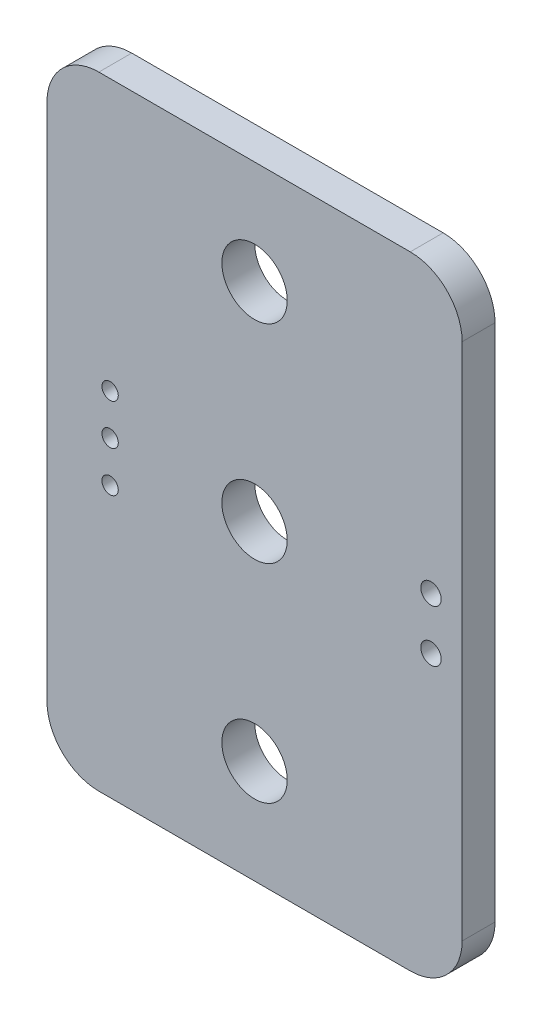
ISO-10303-21;
HEADER;
FILE_DESCRIPTION(('STEP AP214'),'2;1');
FILE_NAME('part.step','',(''),(''),'','','');
FILE_SCHEMA(('AUTOMOTIVE_DESIGN { 1 0 10303 214 1 1 1 1 }'));
ENDSEC;
DATA;
#1=APPLICATION_CONTEXT('core data for automotive mechanical design processes');
#2=APPLICATION_PROTOCOL_DEFINITION('international standard','automotive_design',2000,#1);
#3=PRODUCT_CONTEXT('',#1,'mechanical');
#4=PRODUCT('Part','Part','',(#3));
#5=PRODUCT_RELATED_PRODUCT_CATEGORY('part','',(#4));
#6=PRODUCT_DEFINITION_FORMATION('','',#4);
#7=PRODUCT_DEFINITION_CONTEXT('part definition',#1,'design');
#8=PRODUCT_DEFINITION('design','',#6,#7);
#9=PRODUCT_DEFINITION_SHAPE('','',#8);
#10=(LENGTH_UNIT() NAMED_UNIT(*) SI_UNIT(.MILLI.,.METRE.));
#11=(NAMED_UNIT(*) PLANE_ANGLE_UNIT() SI_UNIT($,.RADIAN.));
#12=(NAMED_UNIT(*) SI_UNIT($,.STERADIAN.) SOLID_ANGLE_UNIT());
#13=UNCERTAINTY_MEASURE_WITH_UNIT(LENGTH_MEASURE(1.E-05),#10,'distance_accuracy_value','');
#14=(GEOMETRIC_REPRESENTATION_CONTEXT(3) GLOBAL_UNCERTAINTY_ASSIGNED_CONTEXT((#13)) GLOBAL_UNIT_ASSIGNED_CONTEXT((#10,
#11,#12)) REPRESENTATION_CONTEXT('',''));
#15=CARTESIAN_POINT('',(0.,0.,0.));
#16=DIRECTION('',(0.,0.,1.));
#17=DIRECTION('',(1.,0.,0.));
#18=AXIS2_PLACEMENT_3D('',#15,#16,#17);
#19=CARTESIAN_POINT('',(25.4,27.94,1.61064));
#20=DIRECTION('',(0.,0.,-1.));
#21=DIRECTION('',(-1.,0.,0.));
#22=AXIS2_PLACEMENT_3D('',#19,#20,#21);
#23=CYLINDRICAL_SURFACE('',#22,2.54);
#24=CARTESIAN_POINT('',(25.4,27.94,0.));
#25=DIRECTION('',(0.,0.,1.));
#26=DIRECTION('',(-1.,0.,0.));
#27=AXIS2_PLACEMENT_3D('',#24,#25,#26);
#28=CIRCLE('',#27,2.54);
#29=CARTESIAN_POINT('',(22.86,27.94,0.));
#30=VERTEX_POINT('',#29);
#31=CARTESIAN_POINT('',(25.4,25.4,0.));
#32=VERTEX_POINT('',#31);
#33=EDGE_CURVE('E137',#30,#32,#28,.T.);
#34=ORIENTED_EDGE('',*,*,#33,.T.);
#35=DIRECTION('',(0.,0.,-1.));
#36=VECTOR('',#35,1.);
#37=CARTESIAN_POINT('',(25.4,25.4,1.61064));
#38=LINE('',#37,#36);
#39=CARTESIAN_POINT('',(25.4,25.4,1.61064));
#40=VERTEX_POINT('',#39);
#41=EDGE_CURVE('E11',#40,#32,#38,.T.);
#42=ORIENTED_EDGE('',*,*,#41,.F.);
#43=CARTESIAN_POINT('',(25.4,27.94,1.61064));
#44=DIRECTION('',(0.,0.,1.));
#45=DIRECTION('',(-1.,0.,0.));
#46=AXIS2_PLACEMENT_3D('',#43,#44,#45);
#47=CIRCLE('',#46,2.54);
#48=CARTESIAN_POINT('',(22.86,27.94,1.61064));
#49=VERTEX_POINT('',#48);
#50=EDGE_CURVE('E152',#49,#40,#47,.T.);
#51=ORIENTED_EDGE('',*,*,#50,.F.);
#52=DIRECTION('',(0.,0.,-1.));
#53=VECTOR('',#52,1.);
#54=CARTESIAN_POINT('',(22.86,27.94,1.61064));
#55=LINE('',#54,#53);
#56=EDGE_CURVE('E133',#49,#30,#55,.T.);
#57=ORIENTED_EDGE('',*,*,#56,.T.);
#58=EDGE_LOOP('',(#34,#42,#51,#57));
#59=FACE_BOUND('',#58,.T.);
#60=ADVANCED_FACE('F41',(#59),#23,.T.);
#61=CARTESIAN_POINT('',(40.64,25.4,1.61064));
#62=DIRECTION('',(0.,1.,0.));
#63=DIRECTION('',(0.,0.,1.));
#64=AXIS2_PLACEMENT_3D('',#61,#62,#63);
#65=PLANE('',#64);
#66=DIRECTION('',(1.,0.,0.));
#67=VECTOR('',#66,1.);
#68=CARTESIAN_POINT('',(40.64,25.4,0.));
#69=LINE('',#68,#67);
#70=CARTESIAN_POINT('',(40.64,25.4,0.));
#71=VERTEX_POINT('',#70);
#72=EDGE_CURVE('E140',#32,#71,#69,.T.);
#73=ORIENTED_EDGE('',*,*,#72,.T.);
#74=DIRECTION('',(0.,0.,-1.));
#75=VECTOR('',#74,1.);
#76=CARTESIAN_POINT('',(40.64,25.4,1.61064));
#77=LINE('',#76,#75);
#78=CARTESIAN_POINT('',(40.64,25.4,1.61064));
#79=VERTEX_POINT('',#78);
#80=EDGE_CURVE('E49',#79,#71,#77,.T.);
#81=ORIENTED_EDGE('',*,*,#80,.F.);
#82=DIRECTION('',(1.,0.,0.));
#83=VECTOR('',#82,1.);
#84=CARTESIAN_POINT('',(40.64,25.4,1.61064));
#85=LINE('',#84,#83);
#86=EDGE_CURVE('E100',#40,#79,#85,.T.);
#87=ORIENTED_EDGE('',*,*,#86,.F.);
#88=ORIENTED_EDGE('',*,*,#41,.T.);
#89=EDGE_LOOP('',(#73,#81,#87,#88));
#90=FACE_BOUND('',#89,.T.);
#91=ADVANCED_FACE('F266',(#90),#65,.F.);
#92=CARTESIAN_POINT('',(40.64,27.94,1.61064));
#93=DIRECTION('',(0.,0.,-1.));
#94=DIRECTION('',(-1.,0.,0.));
#95=AXIS2_PLACEMENT_3D('',#92,#93,#94);
#96=CYLINDRICAL_SURFACE('',#95,2.54);
#97=CARTESIAN_POINT('',(40.64,27.94,0.));
#98=DIRECTION('',(0.,0.,1.));
#99=DIRECTION('',(-1.,0.,0.));
#100=AXIS2_PLACEMENT_3D('',#97,#98,#99);
#101=CIRCLE('',#100,2.54);
#102=CARTESIAN_POINT('',(43.18,27.94,0.));
#103=VERTEX_POINT('',#102);
#104=EDGE_CURVE('E143',#71,#103,#101,.T.);
#105=ORIENTED_EDGE('',*,*,#104,.T.);
#106=DIRECTION('',(0.,0.,-1.));
#107=VECTOR('',#106,1.);
#108=CARTESIAN_POINT('',(43.18,27.94,1.61064));
#109=LINE('',#108,#107);
#110=CARTESIAN_POINT('',(43.18,27.94,1.61064));
#111=VERTEX_POINT('',#110);
#112=EDGE_CURVE('E159',#111,#103,#109,.T.);
#113=ORIENTED_EDGE('',*,*,#112,.F.);
#114=CARTESIAN_POINT('',(40.64,27.94,1.61064));
#115=DIRECTION('',(0.,0.,1.));
#116=DIRECTION('',(-1.,0.,0.));
#117=AXIS2_PLACEMENT_3D('',#114,#115,#116);
#118=CIRCLE('',#117,2.54);
#119=EDGE_CURVE('E167',#79,#111,#118,.T.);
#120=ORIENTED_EDGE('',*,*,#119,.F.);
#121=ORIENTED_EDGE('',*,*,#80,.T.);
#122=EDGE_LOOP('',(#105,#113,#120,#121));
#123=FACE_BOUND('',#122,.T.);
#124=ADVANCED_FACE('F165',(#123),#96,.T.);
#125=CARTESIAN_POINT('',(43.18,53.34,1.61064));
#126=DIRECTION('',(-1.,0.,0.));
#127=DIRECTION('',(0.,0.,1.));
#128=AXIS2_PLACEMENT_3D('',#125,#126,#127);
#129=PLANE('',#128);
#130=DIRECTION('',(0.,1.,0.));
#131=VECTOR('',#130,1.);
#132=CARTESIAN_POINT('',(43.18,53.34,0.));
#133=LINE('',#132,#131);
#134=CARTESIAN_POINT('',(43.18,53.34,0.));
#135=VERTEX_POINT('',#134);
#136=EDGE_CURVE('E145',#103,#135,#133,.T.);
#137=ORIENTED_EDGE('',*,*,#136,.T.);
#138=DIRECTION('',(0.,0.,-1.));
#139=VECTOR('',#138,1.);
#140=CARTESIAN_POINT('',(43.18,53.34,1.61064));
#141=LINE('',#140,#139);
#142=CARTESIAN_POINT('',(43.18,53.34,1.61064));
#143=VERTEX_POINT('',#142);
#144=EDGE_CURVE('E156',#143,#135,#141,.T.);
#145=ORIENTED_EDGE('',*,*,#144,.F.);
#146=DIRECTION('',(0.,1.,0.));
#147=VECTOR('',#146,1.);
#148=CARTESIAN_POINT('',(43.18,53.34,1.61064));
#149=LINE('',#148,#147);
#150=EDGE_CURVE('E179',#111,#143,#149,.T.);
#151=ORIENTED_EDGE('',*,*,#150,.F.);
#152=ORIENTED_EDGE('',*,*,#112,.T.);
#153=EDGE_LOOP('',(#137,#145,#151,#152));
#154=FACE_BOUND('',#153,.T.);
#155=ADVANCED_FACE('F175',(#154),#129,.F.);
#156=CARTESIAN_POINT('',(40.64,53.34,1.61064));
#157=DIRECTION('',(0.,0.,-1.));
#158=DIRECTION('',(-1.,0.,0.));
#159=AXIS2_PLACEMENT_3D('',#156,#157,#158);
#160=CYLINDRICAL_SURFACE('',#159,2.54);
#161=CARTESIAN_POINT('',(40.64,53.34,0.));
#162=DIRECTION('',(0.,0.,1.));
#163=DIRECTION('',(-1.,0.,0.));
#164=AXIS2_PLACEMENT_3D('',#161,#162,#163);
#165=CIRCLE('',#164,2.54);
#166=CARTESIAN_POINT('',(40.64,55.88,0.));
#167=VERTEX_POINT('',#166);
#168=EDGE_CURVE('E147',#135,#167,#165,.T.);
#169=ORIENTED_EDGE('',*,*,#168,.T.);
#170=DIRECTION('',(0.,0.,-1.));
#171=VECTOR('',#170,1.);
#172=CARTESIAN_POINT('',(40.64,55.88,1.61064));
#173=LINE('',#172,#171);
#174=CARTESIAN_POINT('',(40.64,55.88,1.61064));
#175=VERTEX_POINT('',#174);
#176=EDGE_CURVE('E128',#175,#167,#173,.T.);
#177=ORIENTED_EDGE('',*,*,#176,.F.);
#178=CARTESIAN_POINT('',(40.64,53.34,1.61064));
#179=DIRECTION('',(0.,0.,1.));
#180=DIRECTION('',(-1.,0.,0.));
#181=AXIS2_PLACEMENT_3D('',#178,#179,#180);
#182=CIRCLE('',#181,2.54);
#183=EDGE_CURVE('E119',#143,#175,#182,.T.);
#184=ORIENTED_EDGE('',*,*,#183,.F.);
#185=ORIENTED_EDGE('',*,*,#144,.T.);
#186=EDGE_LOOP('',(#169,#177,#184,#185));
#187=FACE_BOUND('',#186,.T.);
#188=ADVANCED_FACE('F178',(#187),#160,.T.);
#189=CARTESIAN_POINT('',(25.4,55.88,1.61064));
#190=DIRECTION('',(0.,-1.,0.));
#191=DIRECTION('',(0.,0.,-1.));
#192=AXIS2_PLACEMENT_3D('',#189,#190,#191);
#193=PLANE('',#192);
#194=DIRECTION('',(-1.,0.,0.));
#195=VECTOR('',#194,1.);
#196=CARTESIAN_POINT('',(25.4,55.88,0.));
#197=LINE('',#196,#195);
#198=CARTESIAN_POINT('',(25.4,55.88,0.));
#199=VERTEX_POINT('',#198);
#200=EDGE_CURVE('E127',#167,#199,#197,.T.);
#201=ORIENTED_EDGE('',*,*,#200,.T.);
#202=DIRECTION('',(0.,0.,-1.));
#203=VECTOR('',#202,1.);
#204=CARTESIAN_POINT('',(25.4,55.88,1.61064));
#205=LINE('',#204,#203);
#206=CARTESIAN_POINT('',(25.4,55.88,1.61064));
#207=VERTEX_POINT('',#206);
#208=EDGE_CURVE('E124',#207,#199,#205,.T.);
#209=ORIENTED_EDGE('',*,*,#208,.F.);
#210=DIRECTION('',(-1.,0.,0.));
#211=VECTOR('',#210,1.);
#212=CARTESIAN_POINT('',(25.4,55.88,1.61064));
#213=LINE('',#212,#211);
#214=EDGE_CURVE('E113',#175,#207,#213,.T.);
#215=ORIENTED_EDGE('',*,*,#214,.F.);
#216=ORIENTED_EDGE('',*,*,#176,.T.);
#217=EDGE_LOOP('',(#201,#209,#215,#216));
#218=FACE_BOUND('',#217,.T.);
#219=ADVANCED_FACE('F125',(#218),#193,.F.);
#220=CARTESIAN_POINT('',(25.4,53.34,1.61064));
#221=DIRECTION('',(0.,0.,-1.));
#222=DIRECTION('',(-1.,0.,0.));
#223=AXIS2_PLACEMENT_3D('',#220,#221,#222);
#224=CYLINDRICAL_SURFACE('',#223,2.54);
#225=CARTESIAN_POINT('',(25.4,53.34,0.));
#226=DIRECTION('',(0.,0.,1.));
#227=DIRECTION('',(-1.,0.,0.));
#228=AXIS2_PLACEMENT_3D('',#225,#226,#227);
#229=CIRCLE('',#228,2.54);
#230=CARTESIAN_POINT('',(22.86,53.34,0.));
#231=VERTEX_POINT('',#230);
#232=EDGE_CURVE('E86',#199,#231,#229,.T.);
#233=ORIENTED_EDGE('',*,*,#232,.T.);
#234=DIRECTION('',(0.,0.,-1.));
#235=VECTOR('',#234,1.);
#236=CARTESIAN_POINT('',(22.86,53.34,1.61064));
#237=LINE('',#236,#235);
#238=CARTESIAN_POINT('',(22.86,53.34,1.61064));
#239=VERTEX_POINT('',#238);
#240=EDGE_CURVE('E129',#239,#231,#237,.T.);
#241=ORIENTED_EDGE('',*,*,#240,.F.);
#242=CARTESIAN_POINT('',(25.4,53.34,1.61064));
#243=DIRECTION('',(0.,0.,1.));
#244=DIRECTION('',(-1.,0.,0.));
#245=AXIS2_PLACEMENT_3D('',#242,#243,#244);
#246=CIRCLE('',#245,2.54);
#247=EDGE_CURVE('E117',#207,#239,#246,.T.);
#248=ORIENTED_EDGE('',*,*,#247,.F.);
#249=ORIENTED_EDGE('',*,*,#208,.T.);
#250=EDGE_LOOP('',(#233,#241,#248,#249));
#251=FACE_BOUND('',#250,.T.);
#252=ADVANCED_FACE('F131',(#251),#224,.T.);
#253=CARTESIAN_POINT('',(22.86,27.94,1.61064));
#254=DIRECTION('',(1.,0.,0.));
#255=DIRECTION('',(0.,0.,-1.));
#256=AXIS2_PLACEMENT_3D('',#253,#254,#255);
#257=PLANE('',#256);
#258=DIRECTION('',(0.,-1.,0.));
#259=VECTOR('',#258,1.);
#260=CARTESIAN_POINT('',(22.86,27.94,0.));
#261=LINE('',#260,#259);
#262=EDGE_CURVE('E92',#231,#30,#261,.T.);
#263=ORIENTED_EDGE('',*,*,#262,.T.);
#264=ORIENTED_EDGE('',*,*,#56,.F.);
#265=DIRECTION('',(0.,-1.,0.));
#266=VECTOR('',#265,1.);
#267=CARTESIAN_POINT('',(22.86,27.94,1.61064));
#268=LINE('',#267,#266);
#269=EDGE_CURVE('E57',#239,#49,#268,.T.);
#270=ORIENTED_EDGE('',*,*,#269,.F.);
#271=ORIENTED_EDGE('',*,*,#240,.T.);
#272=EDGE_LOOP('',(#263,#264,#270,#271));
#273=FACE_BOUND('',#272,.T.);
#274=ADVANCED_FACE('F273',(#273),#257,.F.);
#275=CARTESIAN_POINT('',(25.4,27.94,1.61064));
#276=DIRECTION('',(0.,0.,-1.));
#277=DIRECTION('',(-1.,0.,0.));
#278=AXIS2_PLACEMENT_3D('',#275,#276,#277);
#279=PLANE('',#278);
#280=CARTESIAN_POINT('',(33.02,30.48,1.61064));
#281=DIRECTION('',(0.,0.,-1.));
#282=DIRECTION('',(-1.,0.,0.));
#283=AXIS2_PLACEMENT_3D('',#280,#281,#282);
#284=CIRCLE('',#283,1.59999999999999);
#285=CARTESIAN_POINT('',(31.42,30.48,1.61064));
#286=VERTEX_POINT('',#285);
#287=EDGE_CURVE('E226',#286,#286,#284,.T.);
#288=ORIENTED_EDGE('',*,*,#287,.T.);
#289=EDGE_LOOP('',(#288));
#290=FACE_BOUND('',#289,.T.);
#291=CARTESIAN_POINT('',(33.02,50.8,1.61064));
#292=DIRECTION('',(0.,0.,-1.));
#293=DIRECTION('',(-1.,0.,0.));
#294=AXIS2_PLACEMENT_3D('',#291,#292,#293);
#295=CIRCLE('',#294,1.59999999999999);
#296=CARTESIAN_POINT('',(31.42,50.8,1.61064));
#297=VERTEX_POINT('',#296);
#298=EDGE_CURVE('E220',#297,#297,#295,.T.);
#299=ORIENTED_EDGE('',*,*,#298,.T.);
#300=EDGE_LOOP('',(#299));
#301=FACE_BOUND('',#300,.T.);
#302=CARTESIAN_POINT('',(25.95,42.64,1.61064));
#303=DIRECTION('',(0.,0.,-1.));
#304=DIRECTION('',(-1.,0.,0.));
#305=AXIS2_PLACEMENT_3D('',#302,#303,#304);
#306=CIRCLE('',#305,0.399999999999987);
#307=CARTESIAN_POINT('',(25.55,42.64,1.61064));
#308=VERTEX_POINT('',#307);
#309=EDGE_CURVE('E214',#308,#308,#306,.T.);
#310=ORIENTED_EDGE('',*,*,#309,.T.);
#311=EDGE_LOOP('',(#310));
#312=FACE_BOUND('',#311,.T.);
#313=CARTESIAN_POINT('',(25.95,40.64,1.61064));
#314=DIRECTION('',(0.,0.,-1.));
#315=DIRECTION('',(-1.,0.,0.));
#316=AXIS2_PLACEMENT_3D('',#313,#314,#315);
#317=CIRCLE('',#316,0.399999999999987);
#318=CARTESIAN_POINT('',(25.55,40.64,1.61064));
#319=VERTEX_POINT('',#318);
#320=EDGE_CURVE('E208',#319,#319,#317,.T.);
#321=ORIENTED_EDGE('',*,*,#320,.T.);
#322=EDGE_LOOP('',(#321));
#323=FACE_BOUND('',#322,.T.);
#324=CARTESIAN_POINT('',(25.95,38.64,1.61064));
#325=DIRECTION('',(0.,0.,-1.));
#326=DIRECTION('',(-1.,0.,0.));
#327=AXIS2_PLACEMENT_3D('',#324,#325,#326);
#328=CIRCLE('',#327,0.399999999999987);
#329=CARTESIAN_POINT('',(25.55,38.64,1.61064));
#330=VERTEX_POINT('',#329);
#331=EDGE_CURVE('E202',#330,#330,#328,.T.);
#332=ORIENTED_EDGE('',*,*,#331,.T.);
#333=EDGE_LOOP('',(#332));
#334=FACE_BOUND('',#333,.T.);
#335=CARTESIAN_POINT('',(41.656,41.91,1.61064));
#336=DIRECTION('',(0.,0.,-1.));
#337=DIRECTION('',(-1.,0.,0.));
#338=AXIS2_PLACEMENT_3D('',#335,#336,#337);
#339=CIRCLE('',#338,0.499999999999987);
#340=CARTESIAN_POINT('',(41.156,41.91,1.61064));
#341=VERTEX_POINT('',#340);
#342=EDGE_CURVE('E196',#341,#341,#339,.T.);
#343=ORIENTED_EDGE('',*,*,#342,.T.);
#344=EDGE_LOOP('',(#343));
#345=FACE_BOUND('',#344,.T.);
#346=CARTESIAN_POINT('',(41.656,39.37,1.61064));
#347=DIRECTION('',(0.,0.,-1.));
#348=DIRECTION('',(-1.,0.,0.));
#349=AXIS2_PLACEMENT_3D('',#346,#347,#348);
#350=CIRCLE('',#349,0.499999999999987);
#351=CARTESIAN_POINT('',(41.156,39.37,1.61064));
#352=VERTEX_POINT('',#351);
#353=EDGE_CURVE('E190',#352,#352,#350,.T.);
#354=ORIENTED_EDGE('',*,*,#353,.T.);
#355=EDGE_LOOP('',(#354));
#356=FACE_BOUND('',#355,.T.);
#357=CARTESIAN_POINT('',(33.02,40.64,1.61064));
#358=DIRECTION('',(0.,0.,-1.));
#359=DIRECTION('',(-1.,0.,0.));
#360=AXIS2_PLACEMENT_3D('',#357,#358,#359);
#361=CIRCLE('',#360,1.59999999999999);
#362=CARTESIAN_POINT('',(31.42,40.64,1.61064));
#363=VERTEX_POINT('',#362);
#364=EDGE_CURVE('E141',#363,#363,#361,.T.);
#365=ORIENTED_EDGE('',*,*,#364,.T.);
#366=EDGE_LOOP('',(#365));
#367=FACE_BOUND('',#366,.T.);
#368=ORIENTED_EDGE('',*,*,#50,.T.);
#369=ORIENTED_EDGE('',*,*,#86,.T.);
#370=ORIENTED_EDGE('',*,*,#119,.T.);
#371=ORIENTED_EDGE('',*,*,#150,.T.);
#372=ORIENTED_EDGE('',*,*,#183,.T.);
#373=ORIENTED_EDGE('',*,*,#214,.T.);
#374=ORIENTED_EDGE('',*,*,#247,.T.);
#375=ORIENTED_EDGE('',*,*,#269,.T.);
#376=EDGE_LOOP('',(#368,#369,#370,#371,#372,#373,#374,#375));
#377=FACE_BOUND('',#376,.T.);
#378=ADVANCED_FACE('F115',(#290,#301,#312,#323,#334,#345,#356,#367,#377),#279,.F.);
#379=CARTESIAN_POINT('',(25.4,27.94,0.));
#380=DIRECTION('',(0.,0.,-1.));
#381=DIRECTION('',(-1.,0.,0.));
#382=AXIS2_PLACEMENT_3D('',#379,#380,#381);
#383=PLANE('',#382);
#384=CARTESIAN_POINT('',(33.02,30.48,0.));
#385=DIRECTION('',(0.,0.,-1.));
#386=DIRECTION('',(-1.,0.,0.));
#387=AXIS2_PLACEMENT_3D('',#384,#385,#386);
#388=CIRCLE('',#387,1.59999999999998);
#389=CARTESIAN_POINT('',(31.42,30.48,0.));
#390=VERTEX_POINT('',#389);
#391=EDGE_CURVE('E229',#390,#390,#388,.T.);
#392=ORIENTED_EDGE('',*,*,#391,.F.);
#393=EDGE_LOOP('',(#392));
#394=FACE_BOUND('',#393,.T.);
#395=CARTESIAN_POINT('',(33.02,50.8,0.));
#396=DIRECTION('',(0.,0.,-1.));
#397=DIRECTION('',(-1.,0.,0.));
#398=AXIS2_PLACEMENT_3D('',#395,#396,#397);
#399=CIRCLE('',#398,1.59999999999998);
#400=CARTESIAN_POINT('',(31.42,50.8,0.));
#401=VERTEX_POINT('',#400);
#402=EDGE_CURVE('E223',#401,#401,#399,.T.);
#403=ORIENTED_EDGE('',*,*,#402,.F.);
#404=EDGE_LOOP('',(#403));
#405=FACE_BOUND('',#404,.T.);
#406=CARTESIAN_POINT('',(25.95,42.64,0.));
#407=DIRECTION('',(0.,0.,-1.));
#408=DIRECTION('',(-1.,0.,0.));
#409=AXIS2_PLACEMENT_3D('',#406,#407,#408);
#410=CIRCLE('',#409,0.399999999999987);
#411=CARTESIAN_POINT('',(25.55,42.64,0.));
#412=VERTEX_POINT('',#411);
#413=EDGE_CURVE('E217',#412,#412,#410,.T.);
#414=ORIENTED_EDGE('',*,*,#413,.F.);
#415=EDGE_LOOP('',(#414));
#416=FACE_BOUND('',#415,.T.);
#417=CARTESIAN_POINT('',(25.95,40.64,0.));
#418=DIRECTION('',(0.,0.,-1.));
#419=DIRECTION('',(-1.,0.,0.));
#420=AXIS2_PLACEMENT_3D('',#417,#418,#419);
#421=CIRCLE('',#420,0.399999999999987);
#422=CARTESIAN_POINT('',(25.55,40.64,0.));
#423=VERTEX_POINT('',#422);
#424=EDGE_CURVE('E211',#423,#423,#421,.T.);
#425=ORIENTED_EDGE('',*,*,#424,.F.);
#426=EDGE_LOOP('',(#425));
#427=FACE_BOUND('',#426,.T.);
#428=CARTESIAN_POINT('',(25.95,38.64,0.));
#429=DIRECTION('',(0.,0.,-1.));
#430=DIRECTION('',(-1.,0.,0.));
#431=AXIS2_PLACEMENT_3D('',#428,#429,#430);
#432=CIRCLE('',#431,0.399999999999987);
#433=CARTESIAN_POINT('',(25.55,38.64,0.));
#434=VERTEX_POINT('',#433);
#435=EDGE_CURVE('E205',#434,#434,#432,.T.);
#436=ORIENTED_EDGE('',*,*,#435,.F.);
#437=EDGE_LOOP('',(#436));
#438=FACE_BOUND('',#437,.T.);
#439=CARTESIAN_POINT('',(41.656,41.91,0.));
#440=DIRECTION('',(0.,0.,-1.));
#441=DIRECTION('',(-1.,0.,0.));
#442=AXIS2_PLACEMENT_3D('',#439,#440,#441);
#443=CIRCLE('',#442,0.499999999999987);
#444=CARTESIAN_POINT('',(41.156,41.91,0.));
#445=VERTEX_POINT('',#444);
#446=EDGE_CURVE('E199',#445,#445,#443,.T.);
#447=ORIENTED_EDGE('',*,*,#446,.F.);
#448=EDGE_LOOP('',(#447));
#449=FACE_BOUND('',#448,.T.);
#450=CARTESIAN_POINT('',(41.656,39.37,0.));
#451=DIRECTION('',(0.,0.,-1.));
#452=DIRECTION('',(-1.,0.,0.));
#453=AXIS2_PLACEMENT_3D('',#450,#451,#452);
#454=CIRCLE('',#453,0.499999999999987);
#455=CARTESIAN_POINT('',(41.156,39.37,0.));
#456=VERTEX_POINT('',#455);
#457=EDGE_CURVE('E193',#456,#456,#454,.T.);
#458=ORIENTED_EDGE('',*,*,#457,.F.);
#459=EDGE_LOOP('',(#458));
#460=FACE_BOUND('',#459,.T.);
#461=CARTESIAN_POINT('',(33.02,40.64,0.));
#462=DIRECTION('',(0.,0.,-1.));
#463=DIRECTION('',(-1.,0.,0.));
#464=AXIS2_PLACEMENT_3D('',#461,#462,#463);
#465=CIRCLE('',#464,1.59999999999998);
#466=CARTESIAN_POINT('',(31.42,40.64,0.));
#467=VERTEX_POINT('',#466);
#468=EDGE_CURVE('E187',#467,#467,#465,.T.);
#469=ORIENTED_EDGE('',*,*,#468,.F.);
#470=EDGE_LOOP('',(#469));
#471=FACE_BOUND('',#470,.T.);
#472=ORIENTED_EDGE('',*,*,#33,.F.);
#473=ORIENTED_EDGE('',*,*,#262,.F.);
#474=ORIENTED_EDGE('',*,*,#232,.F.);
#475=ORIENTED_EDGE('',*,*,#200,.F.);
#476=ORIENTED_EDGE('',*,*,#168,.F.);
#477=ORIENTED_EDGE('',*,*,#136,.F.);
#478=ORIENTED_EDGE('',*,*,#104,.F.);
#479=ORIENTED_EDGE('',*,*,#72,.F.);
#480=EDGE_LOOP('',(#472,#473,#474,#475,#476,#477,#478,#479));
#481=FACE_BOUND('',#480,.T.);
#482=ADVANCED_FACE('F171',(#394,#405,#416,#427,#438,#449,#460,#471,#481),#383,.T.);
#483=CARTESIAN_POINT('',(33.02,40.64,0.));
#484=DIRECTION('',(0.,0.,-1.));
#485=DIRECTION('',(-1.,0.,0.));
#486=AXIS2_PLACEMENT_3D('',#483,#484,#485);
#487=CYLINDRICAL_SURFACE('',#486,1.59999999999999);
#488=ORIENTED_EDGE('',*,*,#364,.F.);
#489=EDGE_LOOP('',(#488));
#490=FACE_BOUND('',#489,.T.);
#491=ORIENTED_EDGE('',*,*,#468,.T.);
#492=EDGE_LOOP('',(#491));
#493=FACE_BOUND('',#492,.T.);
#494=ADVANCED_FACE('F237',(#490,#493),#487,.F.);
#495=CARTESIAN_POINT('',(41.656,39.37,0.));
#496=DIRECTION('',(0.,0.,-1.));
#497=DIRECTION('',(-1.,0.,0.));
#498=AXIS2_PLACEMENT_3D('',#495,#496,#497);
#499=CYLINDRICAL_SURFACE('',#498,0.499999999999987);
#500=ORIENTED_EDGE('',*,*,#353,.F.);
#501=EDGE_LOOP('',(#500));
#502=FACE_BOUND('',#501,.T.);
#503=ORIENTED_EDGE('',*,*,#457,.T.);
#504=EDGE_LOOP('',(#503));
#505=FACE_BOUND('',#504,.T.);
#506=ADVANCED_FACE('F254',(#502,#505),#499,.F.);
#507=CARTESIAN_POINT('',(41.656,41.91,0.));
#508=DIRECTION('',(0.,0.,-1.));
#509=DIRECTION('',(-1.,0.,0.));
#510=AXIS2_PLACEMENT_3D('',#507,#508,#509);
#511=CYLINDRICAL_SURFACE('',#510,0.499999999999987);
#512=ORIENTED_EDGE('',*,*,#342,.F.);
#513=EDGE_LOOP('',(#512));
#514=FACE_BOUND('',#513,.T.);
#515=ORIENTED_EDGE('',*,*,#446,.T.);
#516=EDGE_LOOP('',(#515));
#517=FACE_BOUND('',#516,.T.);
#518=ADVANCED_FACE('F260',(#514,#517),#511,.F.);
#519=CARTESIAN_POINT('',(25.95,38.64,0.));
#520=DIRECTION('',(0.,0.,-1.));
#521=DIRECTION('',(-1.,0.,0.));
#522=AXIS2_PLACEMENT_3D('',#519,#520,#521);
#523=CYLINDRICAL_SURFACE('',#522,0.399999999999987);
#524=ORIENTED_EDGE('',*,*,#331,.F.);
#525=EDGE_LOOP('',(#524));
#526=FACE_BOUND('',#525,.T.);
#527=ORIENTED_EDGE('',*,*,#435,.T.);
#528=EDGE_LOOP('',(#527));
#529=FACE_BOUND('',#528,.T.);
#530=ADVANCED_FACE('F339',(#526,#529),#523,.F.);
#531=CARTESIAN_POINT('',(25.95,40.64,0.));
#532=DIRECTION('',(0.,0.,-1.));
#533=DIRECTION('',(-1.,0.,0.));
#534=AXIS2_PLACEMENT_3D('',#531,#532,#533);
#535=CYLINDRICAL_SURFACE('',#534,0.399999999999987);
#536=ORIENTED_EDGE('',*,*,#320,.F.);
#537=EDGE_LOOP('',(#536));
#538=FACE_BOUND('',#537,.T.);
#539=ORIENTED_EDGE('',*,*,#424,.T.);
#540=EDGE_LOOP('',(#539));
#541=FACE_BOUND('',#540,.T.);
#542=ADVANCED_FACE('F350',(#538,#541),#535,.F.);
#543=CARTESIAN_POINT('',(25.95,42.64,0.));
#544=DIRECTION('',(0.,0.,-1.));
#545=DIRECTION('',(-1.,0.,0.));
#546=AXIS2_PLACEMENT_3D('',#543,#544,#545);
#547=CYLINDRICAL_SURFACE('',#546,0.399999999999987);
#548=ORIENTED_EDGE('',*,*,#309,.F.);
#549=EDGE_LOOP('',(#548));
#550=FACE_BOUND('',#549,.T.);
#551=ORIENTED_EDGE('',*,*,#413,.T.);
#552=EDGE_LOOP('',(#551));
#553=FACE_BOUND('',#552,.T.);
#554=ADVANCED_FACE('F361',(#550,#553),#547,.F.);
#555=CARTESIAN_POINT('',(33.02,50.8,0.));
#556=DIRECTION('',(0.,0.,-1.));
#557=DIRECTION('',(-1.,0.,0.));
#558=AXIS2_PLACEMENT_3D('',#555,#556,#557);
#559=CYLINDRICAL_SURFACE('',#558,1.59999999999999);
#560=ORIENTED_EDGE('',*,*,#298,.F.);
#561=EDGE_LOOP('',(#560));
#562=FACE_BOUND('',#561,.T.);
#563=ORIENTED_EDGE('',*,*,#402,.T.);
#564=EDGE_LOOP('',(#563));
#565=FACE_BOUND('',#564,.T.);
#566=ADVANCED_FACE('F372',(#562,#565),#559,.F.);
#567=CARTESIAN_POINT('',(33.02,30.48,0.));
#568=DIRECTION('',(0.,0.,-1.));
#569=DIRECTION('',(-1.,0.,0.));
#570=AXIS2_PLACEMENT_3D('',#567,#568,#569);
#571=CYLINDRICAL_SURFACE('',#570,1.59999999999999);
#572=ORIENTED_EDGE('',*,*,#287,.F.);
#573=EDGE_LOOP('',(#572));
#574=FACE_BOUND('',#573,.T.);
#575=ORIENTED_EDGE('',*,*,#391,.T.);
#576=EDGE_LOOP('',(#575));
#577=FACE_BOUND('',#576,.T.);
#578=ADVANCED_FACE('F233',(#574,#577),#571,.F.);
#579=CLOSED_SHELL('',(#60,#91,#124,#155,#188,#219,#252,#274,#378,#482,#494,#506,#518,#530,#542,
#554,#566,#578));
#580=MANIFOLD_SOLID_BREP('B2',#579);
#581=ADVANCED_BREP_SHAPE_REPRESENTATION('',(#18,#580),#14);
#582=SHAPE_DEFINITION_REPRESENTATION(#9,#581);
ENDSEC;
END-ISO-10303-21;
